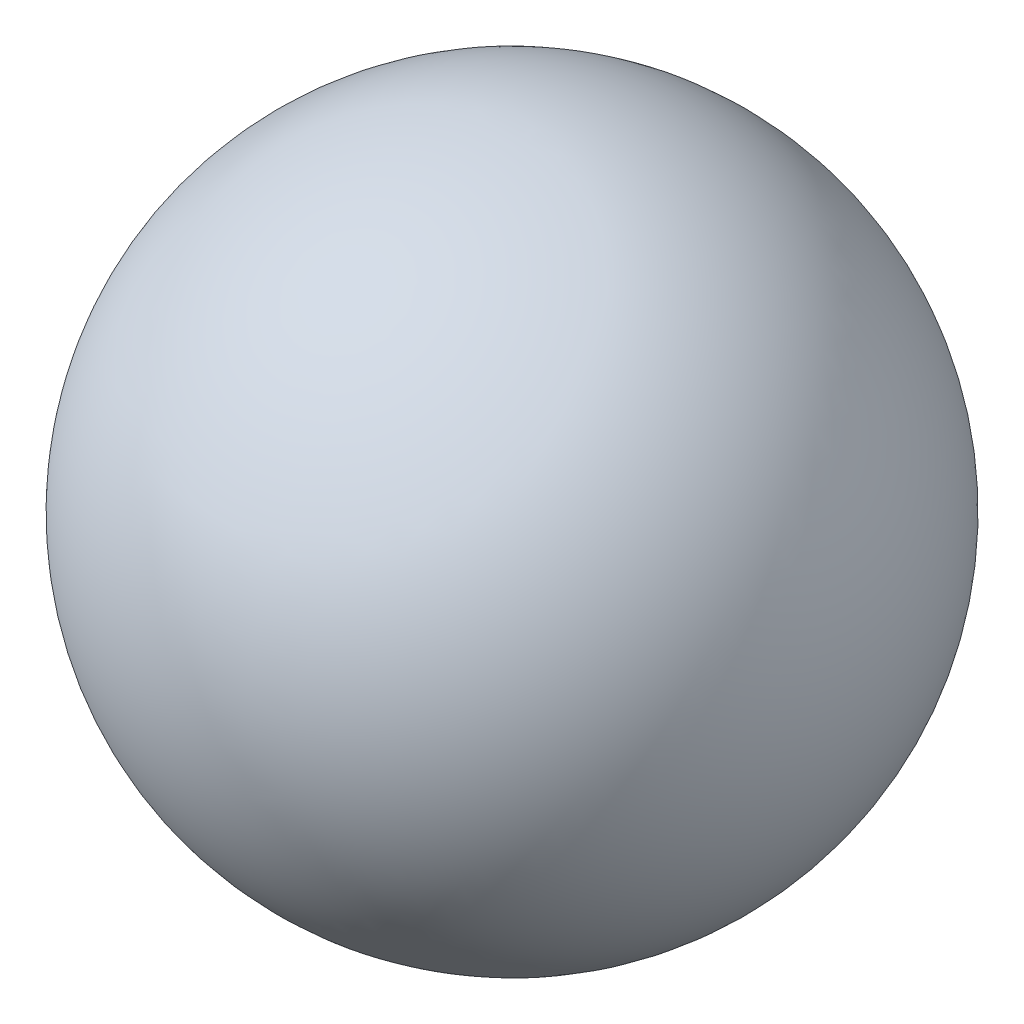
ISO-10303-21;
HEADER;
FILE_DESCRIPTION(('STEP AP214'),'2;1');
FILE_NAME('part.step','',(''),(''),'','','');
FILE_SCHEMA(('AUTOMOTIVE_DESIGN { 1 0 10303 214 1 1 1 1 }'));
ENDSEC;
DATA;
#1=APPLICATION_CONTEXT('core data for automotive mechanical design processes');
#2=APPLICATION_PROTOCOL_DEFINITION('international standard','automotive_design',2000,#1);
#3=PRODUCT_CONTEXT('',#1,'mechanical');
#4=PRODUCT('Part','Part','',(#3));
#5=PRODUCT_RELATED_PRODUCT_CATEGORY('part','',(#4));
#6=PRODUCT_DEFINITION_FORMATION('','',#4);
#7=PRODUCT_DEFINITION_CONTEXT('part definition',#1,'design');
#8=PRODUCT_DEFINITION('design','',#6,#7);
#9=PRODUCT_DEFINITION_SHAPE('','',#8);
#10=(LENGTH_UNIT() NAMED_UNIT(*) SI_UNIT(.MILLI.,.METRE.));
#11=(NAMED_UNIT(*) PLANE_ANGLE_UNIT() SI_UNIT($,.RADIAN.));
#12=(NAMED_UNIT(*) SI_UNIT($,.STERADIAN.) SOLID_ANGLE_UNIT());
#13=UNCERTAINTY_MEASURE_WITH_UNIT(LENGTH_MEASURE(1.E-05),#10,'distance_accuracy_value','');
#14=(GEOMETRIC_REPRESENTATION_CONTEXT(3) GLOBAL_UNCERTAINTY_ASSIGNED_CONTEXT((#13)) GLOBAL_UNIT_ASSIGNED_CONTEXT((#10,
#11,#12)) REPRESENTATION_CONTEXT('',''));
#15=CARTESIAN_POINT('',(0.,0.,0.));
#16=DIRECTION('',(0.,0.,1.));
#17=DIRECTION('',(1.,0.,0.));
#18=AXIS2_PLACEMENT_3D('',#15,#16,#17);
#19=CARTESIAN_POINT('',(64.16,68.0523917870298,-13.5230418569493));
#20=DIRECTION('',(0.,0.980822273280614,-0.194904254024029));
#21=DIRECTION('',(0.173648177666934,0.191943220457923,0.9659213790538));
#22=AXIS2_PLACEMENT_3D('',#19,#20,#21);
#23=SPHERICAL_SURFACE('',#22,7.15);
#24=CARTESIAN_POINT('',(64.16,61.0395125330735,-12.1294764406775));
#25=VERTEX_POINT('',#24);
#26=VERTEX_LOOP('',#25);
#27=FACE_BOUND('',#26,.T.);
#28=CARTESIAN_POINT('',(64.16,75.0652710409861,-14.9166072732211));
#29=VERTEX_POINT('',#28);
#30=VERTEX_LOOP('',#29);
#31=FACE_BOUND('',#30,.T.);
#32=ADVANCED_FACE('F23',(#27,#31),#23,.T.);
#33=CLOSED_SHELL('',(#32));
#34=MANIFOLD_SOLID_BREP('B1',#33);
#35=ADVANCED_BREP_SHAPE_REPRESENTATION('',(#18,#34),#14);
#36=SHAPE_DEFINITION_REPRESENTATION(#9,#35);
ENDSEC;
END-ISO-10303-21;
